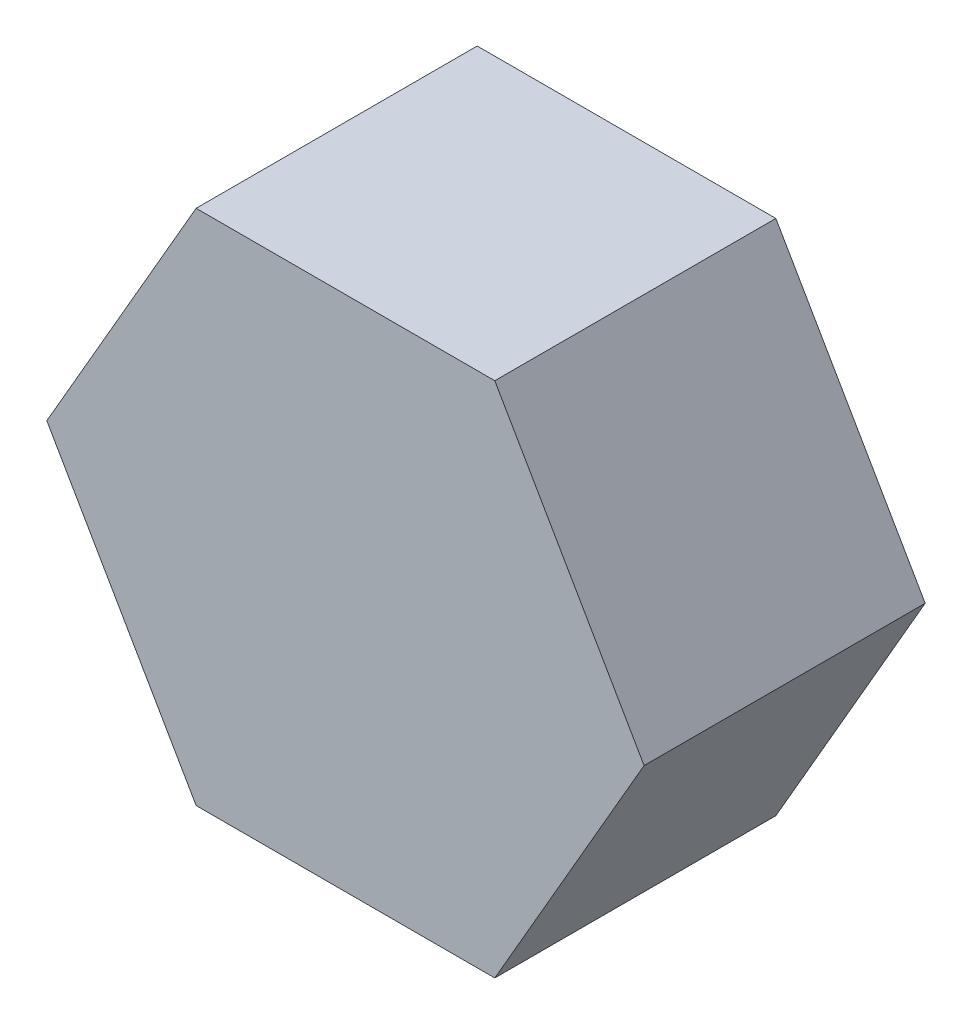
ISO-10303-21;
HEADER;
FILE_DESCRIPTION(('STEP AP214'),'2;1');
FILE_NAME('part.step','',(''),(''),'','','');
FILE_SCHEMA(('AUTOMOTIVE_DESIGN { 1 0 10303 214 1 1 1 1 }'));
ENDSEC;
DATA;
#1=APPLICATION_CONTEXT('core data for automotive mechanical design processes');
#2=APPLICATION_PROTOCOL_DEFINITION('international standard','automotive_design',2000,#1);
#3=PRODUCT_CONTEXT('',#1,'mechanical');
#4=PRODUCT('Part','Part','',(#3));
#5=PRODUCT_RELATED_PRODUCT_CATEGORY('part','',(#4));
#6=PRODUCT_DEFINITION_FORMATION('','',#4);
#7=PRODUCT_DEFINITION_CONTEXT('part definition',#1,'design');
#8=PRODUCT_DEFINITION('design','',#6,#7);
#9=PRODUCT_DEFINITION_SHAPE('','',#8);
#10=(LENGTH_UNIT() NAMED_UNIT(*) SI_UNIT(.MILLI.,.METRE.));
#11=(NAMED_UNIT(*) PLANE_ANGLE_UNIT() SI_UNIT($,.RADIAN.));
#12=(NAMED_UNIT(*) SI_UNIT($,.STERADIAN.) SOLID_ANGLE_UNIT());
#13=UNCERTAINTY_MEASURE_WITH_UNIT(LENGTH_MEASURE(1.E-05),#10,'distance_accuracy_value','');
#14=(GEOMETRIC_REPRESENTATION_CONTEXT(3) GLOBAL_UNCERTAINTY_ASSIGNED_CONTEXT((#13)) GLOBAL_UNIT_ASSIGNED_CONTEXT((#10,
#11,#12)) REPRESENTATION_CONTEXT('',''));
#15=CARTESIAN_POINT('',(0.,0.,0.));
#16=DIRECTION('',(0.,0.,1.));
#17=DIRECTION('',(1.,0.,0.));
#18=AXIS2_PLACEMENT_3D('',#15,#16,#17);
#19=CARTESIAN_POINT('',(-25.1170863556764,17.8577766129253,8.));
#20=DIRECTION('',(0.86602540378444,-0.499999999999997,0.));
#21=DIRECTION('',(0.499999999999997,0.86602540378444,0.));
#22=AXIS2_PLACEMENT_3D('',#19,#20,#21);
#23=PLANE('',#22);
#24=DIRECTION('',(-0.499999999999997,-0.86602540378444,0.));
#25=VECTOR('',#24,1.);
#26=CARTESIAN_POINT('',(-25.1170863556764,17.8577766129253,0.));
#27=LINE('',#26,#25);
#28=CARTESIAN_POINT('',(-20.8670863556764,25.218992545093,0.));
#29=VERTEX_POINT('',#28);
#30=CARTESIAN_POINT('',(-25.1170863556764,17.8577766129253,0.));
#31=VERTEX_POINT('',#30);
#32=EDGE_CURVE('E117',#29,#31,#27,.T.);
#33=ORIENTED_EDGE('',*,*,#32,.T.);
#34=DIRECTION('',(0.,0.,-1.));
#35=VECTOR('',#34,1.);
#36=CARTESIAN_POINT('',(-25.1170863556764,17.8577766129253,8.));
#37=LINE('',#36,#35);
#38=CARTESIAN_POINT('',(-25.1170863556764,17.8577766129253,8.));
#39=VERTEX_POINT('',#38);
#40=EDGE_CURVE('E11',#39,#31,#37,.T.);
#41=ORIENTED_EDGE('',*,*,#40,.F.);
#42=DIRECTION('',(-0.499999999999997,-0.86602540378444,0.));
#43=VECTOR('',#42,1.);
#44=CARTESIAN_POINT('',(-25.1170863556764,17.8577766129253,8.));
#45=LINE('',#44,#43);
#46=CARTESIAN_POINT('',(-20.8670863556764,25.218992545093,8.));
#47=VERTEX_POINT('',#46);
#48=EDGE_CURVE('E127',#47,#39,#45,.T.);
#49=ORIENTED_EDGE('',*,*,#48,.F.);
#50=DIRECTION('',(0.,0.,-1.));
#51=VECTOR('',#50,1.);
#52=CARTESIAN_POINT('',(-20.8670863556764,25.218992545093,8.));
#53=LINE('',#52,#51);
#54=EDGE_CURVE('E113',#47,#29,#53,.T.);
#55=ORIENTED_EDGE('',*,*,#54,.T.);
#56=EDGE_LOOP('',(#33,#41,#49,#55));
#57=FACE_BOUND('',#56,.T.);
#58=ADVANCED_FACE('F33',(#57),#23,.F.);
#59=CARTESIAN_POINT('',(-20.8670863556764,10.4965606807576,8.));
#60=DIRECTION('',(0.866025403784439,0.5,0.));
#61=DIRECTION('',(-0.5,0.866025403784439,0.));
#62=AXIS2_PLACEMENT_3D('',#59,#60,#61);
#63=PLANE('',#62);
#64=DIRECTION('',(0.5,-0.866025403784439,0.));
#65=VECTOR('',#64,1.);
#66=CARTESIAN_POINT('',(-20.8670863556764,10.4965606807576,0.));
#67=LINE('',#66,#65);
#68=CARTESIAN_POINT('',(-20.8670863556764,10.4965606807576,0.));
#69=VERTEX_POINT('',#68);
#70=EDGE_CURVE('E120',#31,#69,#67,.T.);
#71=ORIENTED_EDGE('',*,*,#70,.T.);
#72=DIRECTION('',(0.,0.,-1.));
#73=VECTOR('',#72,1.);
#74=CARTESIAN_POINT('',(-20.8670863556764,10.4965606807576,8.));
#75=LINE('',#74,#73);
#76=CARTESIAN_POINT('',(-20.8670863556764,10.4965606807576,8.));
#77=VERTEX_POINT('',#76);
#78=EDGE_CURVE('E41',#77,#69,#75,.T.);
#79=ORIENTED_EDGE('',*,*,#78,.F.);
#80=DIRECTION('',(0.5,-0.866025403784439,0.));
#81=VECTOR('',#80,1.);
#82=CARTESIAN_POINT('',(-20.8670863556764,10.4965606807576,8.));
#83=LINE('',#82,#81);
#84=EDGE_CURVE('E86',#39,#77,#83,.T.);
#85=ORIENTED_EDGE('',*,*,#84,.F.);
#86=ORIENTED_EDGE('',*,*,#40,.T.);
#87=EDGE_LOOP('',(#71,#79,#85,#86));
#88=FACE_BOUND('',#87,.T.);
#89=ADVANCED_FACE('F151',(#88),#63,.F.);
#90=CARTESIAN_POINT('',(-12.3670863556764,10.4965606807576,8.));
#91=DIRECTION('',(0.,1.,0.));
#92=DIRECTION('',(-1.,0.,0.));
#93=AXIS2_PLACEMENT_3D('',#90,#91,#92);
#94=PLANE('',#93);
#95=DIRECTION('',(1.,0.,0.));
#96=VECTOR('',#95,1.);
#97=CARTESIAN_POINT('',(-12.3670863556764,10.4965606807576,0.));
#98=LINE('',#97,#96);
#99=CARTESIAN_POINT('',(-12.3670863556764,10.4965606807576,0.));
#100=VERTEX_POINT('',#99);
#101=EDGE_CURVE('E122',#69,#100,#98,.T.);
#102=ORIENTED_EDGE('',*,*,#101,.T.);
#103=DIRECTION('',(0.,0.,-1.));
#104=VECTOR('',#103,1.);
#105=CARTESIAN_POINT('',(-12.3670863556764,10.4965606807576,8.));
#106=LINE('',#105,#104);
#107=CARTESIAN_POINT('',(-12.3670863556764,10.4965606807576,8.));
#108=VERTEX_POINT('',#107);
#109=EDGE_CURVE('E108',#108,#100,#106,.T.);
#110=ORIENTED_EDGE('',*,*,#109,.F.);
#111=DIRECTION('',(1.,0.,0.));
#112=VECTOR('',#111,1.);
#113=CARTESIAN_POINT('',(-12.3670863556764,10.4965606807576,8.));
#114=LINE('',#113,#112);
#115=EDGE_CURVE('E99',#77,#108,#114,.T.);
#116=ORIENTED_EDGE('',*,*,#115,.F.);
#117=ORIENTED_EDGE('',*,*,#78,.T.);
#118=EDGE_LOOP('',(#102,#110,#116,#117));
#119=FACE_BOUND('',#118,.T.);
#120=ADVANCED_FACE('F133',(#119),#94,.F.);
#121=CARTESIAN_POINT('',(-8.11708635567641,17.8577766129253,8.));
#122=DIRECTION('',(-0.86602540378444,0.499999999999998,0.));
#123=DIRECTION('',(-0.499999999999998,-0.86602540378444,0.));
#124=AXIS2_PLACEMENT_3D('',#121,#122,#123);
#125=PLANE('',#124);
#126=DIRECTION('',(0.499999999999998,0.86602540378444,0.));
#127=VECTOR('',#126,1.);
#128=CARTESIAN_POINT('',(-8.11708635567641,17.8577766129253,0.));
#129=LINE('',#128,#127);
#130=CARTESIAN_POINT('',(-8.11708635567641,17.8577766129253,0.));
#131=VERTEX_POINT('',#130);
#132=EDGE_CURVE('E107',#100,#131,#129,.T.);
#133=ORIENTED_EDGE('',*,*,#132,.T.);
#134=DIRECTION('',(0.,0.,-1.));
#135=VECTOR('',#134,1.);
#136=CARTESIAN_POINT('',(-8.11708635567641,17.8577766129253,8.));
#137=LINE('',#136,#135);
#138=CARTESIAN_POINT('',(-8.11708635567641,17.8577766129253,8.));
#139=VERTEX_POINT('',#138);
#140=EDGE_CURVE('E104',#139,#131,#137,.T.);
#141=ORIENTED_EDGE('',*,*,#140,.F.);
#142=DIRECTION('',(0.499999999999998,0.86602540378444,0.));
#143=VECTOR('',#142,1.);
#144=CARTESIAN_POINT('',(-8.11708635567641,17.8577766129253,8.));
#145=LINE('',#144,#143);
#146=EDGE_CURVE('E93',#108,#139,#145,.T.);
#147=ORIENTED_EDGE('',*,*,#146,.F.);
#148=ORIENTED_EDGE('',*,*,#109,.T.);
#149=EDGE_LOOP('',(#133,#141,#147,#148));
#150=FACE_BOUND('',#149,.T.);
#151=ADVANCED_FACE('F105',(#150),#125,.F.);
#152=CARTESIAN_POINT('',(-12.3670863556764,25.218992545093,8.));
#153=DIRECTION('',(-0.866025403784439,-0.5,0.));
#154=DIRECTION('',(0.5,-0.866025403784439,0.));
#155=AXIS2_PLACEMENT_3D('',#152,#153,#154);
#156=PLANE('',#155);
#157=DIRECTION('',(-0.5,0.866025403784439,0.));
#158=VECTOR('',#157,1.);
#159=CARTESIAN_POINT('',(-12.3670863556764,25.218992545093,0.));
#160=LINE('',#159,#158);
#161=CARTESIAN_POINT('',(-12.3670863556764,25.218992545093,0.));
#162=VERTEX_POINT('',#161);
#163=EDGE_CURVE('E72',#131,#162,#160,.T.);
#164=ORIENTED_EDGE('',*,*,#163,.T.);
#165=DIRECTION('',(0.,0.,-1.));
#166=VECTOR('',#165,1.);
#167=CARTESIAN_POINT('',(-12.3670863556764,25.218992545093,8.));
#168=LINE('',#167,#166);
#169=CARTESIAN_POINT('',(-12.3670863556764,25.218992545093,8.));
#170=VERTEX_POINT('',#169);
#171=EDGE_CURVE('E109',#170,#162,#168,.T.);
#172=ORIENTED_EDGE('',*,*,#171,.F.);
#173=DIRECTION('',(-0.5,0.866025403784439,0.));
#174=VECTOR('',#173,1.);
#175=CARTESIAN_POINT('',(-12.3670863556764,25.218992545093,8.));
#176=LINE('',#175,#174);
#177=EDGE_CURVE('E97',#139,#170,#176,.T.);
#178=ORIENTED_EDGE('',*,*,#177,.F.);
#179=ORIENTED_EDGE('',*,*,#140,.T.);
#180=EDGE_LOOP('',(#164,#172,#178,#179));
#181=FACE_BOUND('',#180,.T.);
#182=ADVANCED_FACE('F111',(#181),#156,.F.);
#183=CARTESIAN_POINT('',(-20.8670863556764,25.218992545093,8.));
#184=DIRECTION('',(0.,-1.,0.));
#185=DIRECTION('',(0.,0.,-1.));
#186=AXIS2_PLACEMENT_3D('',#183,#184,#185);
#187=PLANE('',#186);
#188=DIRECTION('',(-1.,0.,0.));
#189=VECTOR('',#188,1.);
#190=CARTESIAN_POINT('',(-20.8670863556764,25.218992545093,0.));
#191=LINE('',#190,#189);
#192=EDGE_CURVE('E78',#162,#29,#191,.T.);
#193=ORIENTED_EDGE('',*,*,#192,.T.);
#194=ORIENTED_EDGE('',*,*,#54,.F.);
#195=DIRECTION('',(-1.,0.,0.));
#196=VECTOR('',#195,1.);
#197=CARTESIAN_POINT('',(-20.8670863556764,25.218992545093,8.));
#198=LINE('',#197,#196);
#199=EDGE_CURVE('E49',#170,#47,#198,.T.);
#200=ORIENTED_EDGE('',*,*,#199,.F.);
#201=ORIENTED_EDGE('',*,*,#171,.T.);
#202=EDGE_LOOP('',(#193,#194,#200,#201));
#203=FACE_BOUND('',#202,.T.);
#204=ADVANCED_FACE('F140',(#203),#187,.F.);
#205=CARTESIAN_POINT('',(0.,0.,8.));
#206=DIRECTION('',(0.,0.,-1.));
#207=DIRECTION('',(-1.,0.,0.));
#208=AXIS2_PLACEMENT_3D('',#205,#206,#207);
#209=PLANE('',#208);
#210=ORIENTED_EDGE('',*,*,#48,.T.);
#211=ORIENTED_EDGE('',*,*,#84,.T.);
#212=ORIENTED_EDGE('',*,*,#115,.T.);
#213=ORIENTED_EDGE('',*,*,#146,.T.);
#214=ORIENTED_EDGE('',*,*,#177,.T.);
#215=ORIENTED_EDGE('',*,*,#199,.T.);
#216=EDGE_LOOP('',(#210,#211,#212,#213,#214,#215));
#217=FACE_BOUND('',#216,.T.);
#218=ADVANCED_FACE('F95',(#217),#209,.F.);
#219=CARTESIAN_POINT('',(0.,0.,0.));
#220=DIRECTION('',(0.,0.,-1.));
#221=DIRECTION('',(-1.,0.,0.));
#222=AXIS2_PLACEMENT_3D('',#219,#220,#221);
#223=PLANE('',#222);
#224=ORIENTED_EDGE('',*,*,#32,.F.);
#225=ORIENTED_EDGE('',*,*,#192,.F.);
#226=ORIENTED_EDGE('',*,*,#163,.F.);
#227=ORIENTED_EDGE('',*,*,#132,.F.);
#228=ORIENTED_EDGE('',*,*,#101,.F.);
#229=ORIENTED_EDGE('',*,*,#70,.F.);
#230=EDGE_LOOP('',(#224,#225,#226,#227,#228,#229));
#231=FACE_BOUND('',#230,.T.);
#232=ADVANCED_FACE('F136',(#231),#223,.T.);
#233=CLOSED_SHELL('',(#58,#89,#120,#151,#182,#204,#218,#232));
#234=MANIFOLD_SOLID_BREP('B2',#233);
#235=ADVANCED_BREP_SHAPE_REPRESENTATION('',(#18,#234),#14);
#236=SHAPE_DEFINITION_REPRESENTATION(#9,#235);
ENDSEC;
END-ISO-10303-21;
